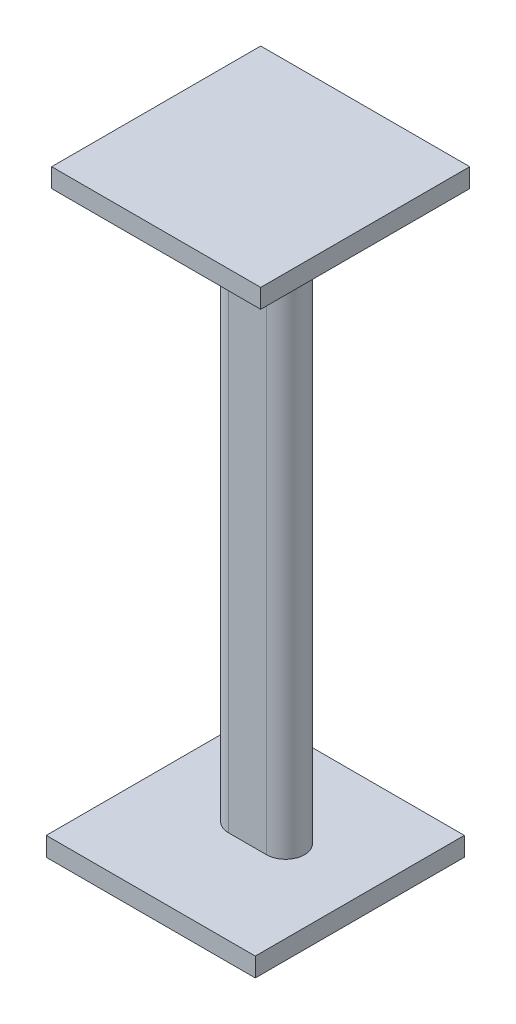
ISO-10303-21;
HEADER;
FILE_DESCRIPTION(('STEP AP214'),'2;1');
FILE_NAME('part.step','',(''),(''),'','','');
FILE_SCHEMA(('AUTOMOTIVE_DESIGN { 1 0 10303 214 1 1 1 1 }'));
ENDSEC;
DATA;
#1=APPLICATION_CONTEXT('core data for automotive mechanical design processes');
#2=APPLICATION_PROTOCOL_DEFINITION('international standard','automotive_design',2000,#1);
#3=PRODUCT_CONTEXT('',#1,'mechanical');
#4=PRODUCT('Part','Part','',(#3));
#5=PRODUCT_RELATED_PRODUCT_CATEGORY('part','',(#4));
#6=PRODUCT_DEFINITION_FORMATION('','',#4);
#7=PRODUCT_DEFINITION_CONTEXT('part definition',#1,'design');
#8=PRODUCT_DEFINITION('design','',#6,#7);
#9=PRODUCT_DEFINITION_SHAPE('','',#8);
#10=(LENGTH_UNIT() NAMED_UNIT(*) SI_UNIT(.MILLI.,.METRE.));
#11=(NAMED_UNIT(*) PLANE_ANGLE_UNIT() SI_UNIT($,.RADIAN.));
#12=(NAMED_UNIT(*) SI_UNIT($,.STERADIAN.) SOLID_ANGLE_UNIT());
#13=UNCERTAINTY_MEASURE_WITH_UNIT(LENGTH_MEASURE(1.E-05),#10,'distance_accuracy_value','');
#14=(GEOMETRIC_REPRESENTATION_CONTEXT(3) GLOBAL_UNCERTAINTY_ASSIGNED_CONTEXT((#13)) GLOBAL_UNIT_ASSIGNED_CONTEXT((#10,
#11,#12)) REPRESENTATION_CONTEXT('',''));
#15=CARTESIAN_POINT('',(0.,0.,0.));
#16=DIRECTION('',(0.,0.,1.));
#17=DIRECTION('',(1.,0.,0.));
#18=AXIS2_PLACEMENT_3D('',#15,#16,#17);
#19=CARTESIAN_POINT('',(0.,38.1,0.));
#20=DIRECTION('',(0.,1.,0.));
#21=DIRECTION('',(0.,0.,1.));
#22=AXIS2_PLACEMENT_3D('',#19,#20,#21);
#23=PLANE('',#22);
#24=DIRECTION('',(0.,0.,1.));
#25=VECTOR('',#24,1.);
#26=CARTESIAN_POINT('',(-391.772860504098,38.1,-296.454880255555));
#27=LINE('',#26,#25);
#28=CARTESIAN_POINT('',(-391.772860504098,38.1,-296.454880255555));
#29=VERTEX_POINT('',#28);
#30=CARTESIAN_POINT('',(-391.772860504098,38.1,122.645119744445));
#31=VERTEX_POINT('',#30);
#32=EDGE_CURVE('E194',#29,#31,#27,.T.);
#33=ORIENTED_EDGE('',*,*,#32,.T.);
#34=DIRECTION('',(1.,0.,0.));
#35=VECTOR('',#34,1.);
#36=CARTESIAN_POINT('',(-391.772860504098,38.1,122.645119744445));
#37=LINE('',#36,#35);
#38=CARTESIAN_POINT('',(27.327139495902,38.1,122.645119744445));
#39=VERTEX_POINT('',#38);
#40=EDGE_CURVE('E87',#31,#39,#37,.T.);
#41=ORIENTED_EDGE('',*,*,#40,.T.);
#42=DIRECTION('',(0.,0.,-1.));
#43=VECTOR('',#42,1.);
#44=CARTESIAN_POINT('',(27.327139495902,38.1,-296.454880255555));
#45=LINE('',#44,#43);
#46=CARTESIAN_POINT('',(27.327139495902,38.1,-296.454880255555));
#47=VERTEX_POINT('',#46);
#48=EDGE_CURVE('E197',#39,#47,#45,.T.);
#49=ORIENTED_EDGE('',*,*,#48,.T.);
#50=DIRECTION('',(-1.,0.,0.));
#51=VECTOR('',#50,1.);
#52=CARTESIAN_POINT('',(-391.772860504098,38.1,-296.454880255555));
#53=LINE('',#52,#51);
#54=EDGE_CURVE('E59',#47,#29,#53,.T.);
#55=ORIENTED_EDGE('',*,*,#54,.T.);
#56=EDGE_LOOP('',(#33,#41,#49,#55));
#57=FACE_BOUND('',#56,.T.);
#58=DIRECTION('',(1.,0.,0.));
#59=VECTOR('',#58,1.);
#60=CARTESIAN_POINT('',(-213.432103513227,38.1,-64.5132983569283));
#61=LINE('',#60,#59);
#62=CARTESIAN_POINT('',(-213.432103513227,38.1,-64.5132983569283));
#63=VERTEX_POINT('',#62);
#64=CARTESIAN_POINT('',(-137.232103513227,38.1,-64.5132983569283));
#65=VERTEX_POINT('',#64);
#66=EDGE_CURVE('E161',#63,#65,#61,.T.);
#67=ORIENTED_EDGE('',*,*,#66,.F.);
#68=CARTESIAN_POINT('',(-213.432103513227,38.1,-102.613298356928));
#69=DIRECTION('',(0.,1.,0.));
#70=DIRECTION('',(0.,0.,1.));
#71=AXIS2_PLACEMENT_3D('',#68,#69,#70);
#72=CIRCLE('',#71,38.1);
#73=CARTESIAN_POINT('',(-213.432103513227,38.1,-140.713298356928));
#74=VERTEX_POINT('',#73);
#75=EDGE_CURVE('E158',#74,#63,#72,.T.);
#76=ORIENTED_EDGE('',*,*,#75,.F.);
#77=DIRECTION('',(-1.,0.,0.));
#78=VECTOR('',#77,1.);
#79=CARTESIAN_POINT('',(-213.432103513227,38.1,-140.713298356928));
#80=LINE('',#79,#78);
#81=CARTESIAN_POINT('',(-137.232103513227,38.1,-140.713298356928));
#82=VERTEX_POINT('',#81);
#83=EDGE_CURVE('E171',#82,#74,#80,.T.);
#84=ORIENTED_EDGE('',*,*,#83,.F.);
#85=CARTESIAN_POINT('',(-137.232103513227,38.1,-102.613298356928));
#86=DIRECTION('',(0.,1.,0.));
#87=DIRECTION('',(0.,0.,1.));
#88=AXIS2_PLACEMENT_3D('',#85,#86,#87);
#89=CIRCLE('',#88,38.1);
#90=EDGE_CURVE('E182',#65,#82,#89,.T.);
#91=ORIENTED_EDGE('',*,*,#90,.F.);
#92=EDGE_LOOP('',(#67,#76,#84,#91));
#93=FACE_BOUND('',#92,.T.);
#94=ADVANCED_FACE('F35',(#57,#93),#23,.T.);
#95=CARTESIAN_POINT('',(-391.772860504098,38.1,-296.454880255555));
#96=DIRECTION('',(1.,0.,0.));
#97=DIRECTION('',(0.,0.,-1.));
#98=AXIS2_PLACEMENT_3D('',#95,#96,#97);
#99=PLANE('',#98);
#100=DIRECTION('',(0.,0.,1.));
#101=VECTOR('',#100,1.);
#102=CARTESIAN_POINT('',(-391.772860504098,0.,-296.454880255555));
#103=LINE('',#102,#101);
#104=CARTESIAN_POINT('',(-391.772860504098,0.,-296.454880255555));
#105=VERTEX_POINT('',#104);
#106=CARTESIAN_POINT('',(-391.772860504098,0.,122.645119744445));
#107=VERTEX_POINT('',#106);
#108=EDGE_CURVE('E193',#105,#107,#103,.T.);
#109=ORIENTED_EDGE('',*,*,#108,.T.);
#110=DIRECTION('',(0.,-1.,0.));
#111=VECTOR('',#110,1.);
#112=CARTESIAN_POINT('',(-391.772860504098,38.1,122.645119744445));
#113=LINE('',#112,#111);
#114=EDGE_CURVE('E11',#31,#107,#113,.T.);
#115=ORIENTED_EDGE('',*,*,#114,.F.);
#116=ORIENTED_EDGE('',*,*,#32,.F.);
#117=DIRECTION('',(0.,-1.,0.));
#118=VECTOR('',#117,1.);
#119=CARTESIAN_POINT('',(-391.772860504098,38.1,-296.454880255555));
#120=LINE('',#119,#118);
#121=EDGE_CURVE('E200',#29,#105,#120,.T.);
#122=ORIENTED_EDGE('',*,*,#121,.T.);
#123=EDGE_LOOP('',(#109,#115,#116,#122));
#124=FACE_BOUND('',#123,.T.);
#125=ADVANCED_FACE('F37',(#124),#99,.F.);
#126=CARTESIAN_POINT('',(-391.772860504098,38.1,122.645119744445));
#127=DIRECTION('',(0.,0.,-1.));
#128=DIRECTION('',(-1.,0.,0.));
#129=AXIS2_PLACEMENT_3D('',#126,#127,#128);
#130=PLANE('',#129);
#131=DIRECTION('',(1.,0.,0.));
#132=VECTOR('',#131,1.);
#133=CARTESIAN_POINT('',(-391.772860504098,0.,122.645119744445));
#134=LINE('',#133,#132);
#135=CARTESIAN_POINT('',(27.327139495902,0.,122.645119744445));
#136=VERTEX_POINT('',#135);
#137=EDGE_CURVE('E203',#107,#136,#134,.T.);
#138=ORIENTED_EDGE('',*,*,#137,.T.);
#139=DIRECTION('',(0.,-1.,0.));
#140=VECTOR('',#139,1.);
#141=CARTESIAN_POINT('',(27.327139495902,38.1,122.645119744445));
#142=LINE('',#141,#140);
#143=EDGE_CURVE('E43',#39,#136,#142,.T.);
#144=ORIENTED_EDGE('',*,*,#143,.F.);
#145=ORIENTED_EDGE('',*,*,#40,.F.);
#146=ORIENTED_EDGE('',*,*,#114,.T.);
#147=EDGE_LOOP('',(#138,#144,#145,#146));
#148=FACE_BOUND('',#147,.T.);
#149=ADVANCED_FACE('F231',(#148),#130,.F.);
#150=CARTESIAN_POINT('',(27.327139495902,38.1,-296.454880255555));
#151=DIRECTION('',(-1.,0.,0.));
#152=DIRECTION('',(0.,0.,1.));
#153=AXIS2_PLACEMENT_3D('',#150,#151,#152);
#154=PLANE('',#153);
#155=DIRECTION('',(0.,0.,-1.));
#156=VECTOR('',#155,1.);
#157=CARTESIAN_POINT('',(27.327139495902,0.,-296.454880255555));
#158=LINE('',#157,#156);
#159=CARTESIAN_POINT('',(27.327139495902,0.,-296.454880255555));
#160=VERTEX_POINT('',#159);
#161=EDGE_CURVE('E205',#136,#160,#158,.T.);
#162=ORIENTED_EDGE('',*,*,#161,.T.);
#163=DIRECTION('',(0.,-1.,0.));
#164=VECTOR('',#163,1.);
#165=CARTESIAN_POINT('',(27.327139495902,38.1,-296.454880255555));
#166=LINE('',#165,#164);
#167=EDGE_CURVE('E209',#47,#160,#166,.T.);
#168=ORIENTED_EDGE('',*,*,#167,.F.);
#169=ORIENTED_EDGE('',*,*,#48,.F.);
#170=ORIENTED_EDGE('',*,*,#143,.T.);
#171=EDGE_LOOP('',(#162,#168,#169,#170));
#172=FACE_BOUND('',#171,.T.);
#173=ADVANCED_FACE('F214',(#172),#154,.F.);
#174=CARTESIAN_POINT('',(-391.772860504098,38.1,-296.454880255555));
#175=DIRECTION('',(0.,0.,1.));
#176=DIRECTION('',(1.,0.,0.));
#177=AXIS2_PLACEMENT_3D('',#174,#175,#176);
#178=PLANE('',#177);
#179=DIRECTION('',(-1.,0.,0.));
#180=VECTOR('',#179,1.);
#181=CARTESIAN_POINT('',(-391.772860504098,0.,-296.454880255555));
#182=LINE('',#181,#180);
#183=EDGE_CURVE('E80',#160,#105,#182,.T.);
#184=ORIENTED_EDGE('',*,*,#183,.T.);
#185=ORIENTED_EDGE('',*,*,#121,.F.);
#186=ORIENTED_EDGE('',*,*,#54,.F.);
#187=ORIENTED_EDGE('',*,*,#167,.T.);
#188=EDGE_LOOP('',(#184,#185,#186,#187));
#189=FACE_BOUND('',#188,.T.);
#190=ADVANCED_FACE('F222',(#189),#178,.F.);
#191=CARTESIAN_POINT('',(0.,0.,0.));
#192=DIRECTION('',(0.,1.,0.));
#193=DIRECTION('',(0.,0.,1.));
#194=AXIS2_PLACEMENT_3D('',#191,#192,#193);
#195=PLANE('',#194);
#196=ORIENTED_EDGE('',*,*,#108,.F.);
#197=ORIENTED_EDGE('',*,*,#183,.F.);
#198=ORIENTED_EDGE('',*,*,#161,.F.);
#199=ORIENTED_EDGE('',*,*,#137,.F.);
#200=EDGE_LOOP('',(#196,#197,#198,#199));
#201=FACE_BOUND('',#200,.T.);
#202=ADVANCED_FACE('F218',(#201),#195,.F.);
#203=CARTESIAN_POINT('',(-213.432103513227,1155.7,-102.613298356928));
#204=DIRECTION('',(0.,-1.,0.));
#205=DIRECTION('',(0.,0.,-1.));
#206=AXIS2_PLACEMENT_3D('',#203,#204,#205);
#207=CYLINDRICAL_SURFACE('',#206,38.1);
#208=ORIENTED_EDGE('',*,*,#75,.T.);
#209=DIRECTION('',(0.,-1.,0.));
#210=VECTOR('',#209,1.);
#211=CARTESIAN_POINT('',(-213.432103513227,1155.7,-64.5132983569283));
#212=LINE('',#211,#210);
#213=CARTESIAN_POINT('',(-213.432103513227,1155.7,-64.5132983569283));
#214=VERTEX_POINT('',#213);
#215=EDGE_CURVE('E191',#214,#63,#212,.T.);
#216=ORIENTED_EDGE('',*,*,#215,.F.);
#217=CARTESIAN_POINT('',(-213.432103513227,1155.7,-102.613298356928));
#218=DIRECTION('',(0.,1.,0.));
#219=DIRECTION('',(0.,0.,1.));
#220=AXIS2_PLACEMENT_3D('',#217,#218,#219);
#221=CIRCLE('',#220,38.1);
#222=CARTESIAN_POINT('',(-213.432103513227,1155.7,-140.713298356928));
#223=VERTEX_POINT('',#222);
#224=EDGE_CURVE('E167',#223,#214,#221,.T.);
#225=ORIENTED_EDGE('',*,*,#224,.F.);
#226=DIRECTION('',(0.,-1.,0.));
#227=VECTOR('',#226,1.);
#228=CARTESIAN_POINT('',(-213.432103513227,1155.7,-140.713298356928));
#229=LINE('',#228,#227);
#230=EDGE_CURVE('E179',#223,#74,#229,.T.);
#231=ORIENTED_EDGE('',*,*,#230,.T.);
#232=EDGE_LOOP('',(#208,#216,#225,#231));
#233=FACE_BOUND('',#232,.T.);
#234=ADVANCED_FACE('F229',(#233),#207,.T.);
#235=CARTESIAN_POINT('',(-213.432103513227,1155.7,-64.5132983569283));
#236=DIRECTION('',(0.,0.,-1.));
#237=DIRECTION('',(-1.,0.,0.));
#238=AXIS2_PLACEMENT_3D('',#235,#236,#237);
#239=PLANE('',#238);
#240=ORIENTED_EDGE('',*,*,#66,.T.);
#241=DIRECTION('',(0.,-1.,0.));
#242=VECTOR('',#241,1.);
#243=CARTESIAN_POINT('',(-137.232103513227,1155.7,-64.5132983569283));
#244=LINE('',#243,#242);
#245=CARTESIAN_POINT('',(-137.232103513227,1155.7,-64.5132983569283));
#246=VERTEX_POINT('',#245);
#247=EDGE_CURVE('E188',#246,#65,#244,.T.);
#248=ORIENTED_EDGE('',*,*,#247,.F.);
#249=DIRECTION('',(1.,0.,0.));
#250=VECTOR('',#249,1.);
#251=CARTESIAN_POINT('',(-213.432103513227,1155.7,-64.5132983569283));
#252=LINE('',#251,#250);
#253=EDGE_CURVE('E170',#214,#246,#252,.T.);
#254=ORIENTED_EDGE('',*,*,#253,.F.);
#255=ORIENTED_EDGE('',*,*,#215,.T.);
#256=EDGE_LOOP('',(#240,#248,#254,#255));
#257=FACE_BOUND('',#256,.T.);
#258=ADVANCED_FACE('F244',(#257),#239,.F.);
#259=CARTESIAN_POINT('',(-137.232103513227,1155.7,-102.613298356928));
#260=DIRECTION('',(0.,-1.,0.));
#261=DIRECTION('',(0.,0.,-1.));
#262=AXIS2_PLACEMENT_3D('',#259,#260,#261);
#263=CYLINDRICAL_SURFACE('',#262,38.1);
#264=ORIENTED_EDGE('',*,*,#90,.T.);
#265=DIRECTION('',(0.,-1.,0.));
#266=VECTOR('',#265,1.);
#267=CARTESIAN_POINT('',(-137.232103513227,1155.7,-140.713298356928));
#268=LINE('',#267,#266);
#269=CARTESIAN_POINT('',(-137.232103513227,1155.7,-140.713298356928));
#270=VERTEX_POINT('',#269);
#271=EDGE_CURVE('E50',#270,#82,#268,.T.);
#272=ORIENTED_EDGE('',*,*,#271,.F.);
#273=CARTESIAN_POINT('',(-137.232103513227,1155.7,-102.613298356928));
#274=DIRECTION('',(0.,1.,0.));
#275=DIRECTION('',(0.,0.,1.));
#276=AXIS2_PLACEMENT_3D('',#273,#274,#275);
#277=CIRCLE('',#276,38.1);
#278=EDGE_CURVE('E174',#246,#270,#277,.T.);
#279=ORIENTED_EDGE('',*,*,#278,.F.);
#280=ORIENTED_EDGE('',*,*,#247,.T.);
#281=EDGE_LOOP('',(#264,#272,#279,#280));
#282=FACE_BOUND('',#281,.T.);
#283=ADVANCED_FACE('F248',(#282),#263,.T.);
#284=CARTESIAN_POINT('',(-213.432103513227,1155.7,-140.713298356928));
#285=DIRECTION('',(0.,0.,1.));
#286=DIRECTION('',(1.,0.,0.));
#287=AXIS2_PLACEMENT_3D('',#284,#285,#286);
#288=PLANE('',#287);
#289=ORIENTED_EDGE('',*,*,#83,.T.);
#290=ORIENTED_EDGE('',*,*,#230,.F.);
#291=DIRECTION('',(-1.,0.,0.));
#292=VECTOR('',#291,1.);
#293=CARTESIAN_POINT('',(-213.432103513227,1155.7,-140.713298356928));
#294=LINE('',#293,#292);
#295=EDGE_CURVE('E177',#270,#223,#294,.T.);
#296=ORIENTED_EDGE('',*,*,#295,.F.);
#297=ORIENTED_EDGE('',*,*,#271,.T.);
#298=EDGE_LOOP('',(#289,#290,#296,#297));
#299=FACE_BOUND('',#298,.T.);
#300=ADVANCED_FACE('F252',(#299),#288,.F.);
#301=CARTESIAN_POINT('',(27.3817389119318,1193.8,-307.251559627694));
#302=DIRECTION('',(-1.,0.,0.));
#303=DIRECTION('',(0.,0.,1.));
#304=AXIS2_PLACEMENT_3D('',#301,#302,#303);
#305=PLANE('',#304);
#306=DIRECTION('',(0.,0.,-1.));
#307=VECTOR('',#306,1.);
#308=CARTESIAN_POINT('',(27.3817389119318,1155.7,-307.251559627694));
#309=LINE('',#308,#307);
#310=CARTESIAN_POINT('',(27.3817389119319,1155.7,111.848440372306));
#311=VERTEX_POINT('',#310);
#312=CARTESIAN_POINT('',(27.3817389119318,1155.7,-307.251559627694));
#313=VERTEX_POINT('',#312);
#314=EDGE_CURVE('E157',#311,#313,#309,.T.);
#315=ORIENTED_EDGE('',*,*,#314,.T.);
#316=DIRECTION('',(0.,-1.,0.));
#317=VECTOR('',#316,1.);
#318=CARTESIAN_POINT('',(27.3817389119318,1193.8,-307.251559627694));
#319=LINE('',#318,#317);
#320=CARTESIAN_POINT('',(27.3817389119318,1193.8,-307.251559627694));
#321=VERTEX_POINT('',#320);
#322=EDGE_CURVE('E137',#321,#313,#319,.T.);
#323=ORIENTED_EDGE('',*,*,#322,.F.);
#324=DIRECTION('',(0.,0.,-1.));
#325=VECTOR('',#324,1.);
#326=CARTESIAN_POINT('',(27.3817389119318,1193.8,-307.251559627694));
#327=LINE('',#326,#325);
#328=CARTESIAN_POINT('',(27.3817389119319,1193.8,111.848440372306));
#329=VERTEX_POINT('',#328);
#330=EDGE_CURVE('E144',#329,#321,#327,.T.);
#331=ORIENTED_EDGE('',*,*,#330,.F.);
#332=DIRECTION('',(0.,-1.,0.));
#333=VECTOR('',#332,1.);
#334=CARTESIAN_POINT('',(27.3817389119319,1193.8,111.848440372306));
#335=LINE('',#334,#333);
#336=EDGE_CURVE('E384',#329,#311,#335,.T.);
#337=ORIENTED_EDGE('',*,*,#336,.T.);
#338=EDGE_LOOP('',(#315,#323,#331,#337));
#339=FACE_BOUND('',#338,.T.);
#340=ADVANCED_FACE('F155',(#339),#305,.F.);
#341=CARTESIAN_POINT('',(27.3817389119318,1193.8,-307.251559627694));
#342=DIRECTION('',(0.,0.,1.));
#343=DIRECTION('',(1.,0.,0.));
#344=AXIS2_PLACEMENT_3D('',#341,#342,#343);
#345=PLANE('',#344);
#346=DIRECTION('',(-1.,0.,0.));
#347=VECTOR('',#346,1.);
#348=CARTESIAN_POINT('',(27.3817389119318,1155.7,-307.251559627694));
#349=LINE('',#348,#347);
#350=CARTESIAN_POINT('',(-391.718261088068,1155.7,-307.251559627694));
#351=VERTEX_POINT('',#350);
#352=EDGE_CURVE('E375',#313,#351,#349,.T.);
#353=ORIENTED_EDGE('',*,*,#352,.T.);
#354=DIRECTION('',(0.,-1.,0.));
#355=VECTOR('',#354,1.);
#356=CARTESIAN_POINT('',(-391.718261088068,1193.8,-307.251559627694));
#357=LINE('',#356,#355);
#358=CARTESIAN_POINT('',(-391.718261088068,1193.8,-307.251559627694));
#359=VERTEX_POINT('',#358);
#360=EDGE_CURVE('E140',#359,#351,#357,.T.);
#361=ORIENTED_EDGE('',*,*,#360,.F.);
#362=DIRECTION('',(-1.,0.,0.));
#363=VECTOR('',#362,1.);
#364=CARTESIAN_POINT('',(27.3817389119318,1193.8,-307.251559627694));
#365=LINE('',#364,#363);
#366=EDGE_CURVE('E133',#321,#359,#365,.T.);
#367=ORIENTED_EDGE('',*,*,#366,.F.);
#368=ORIENTED_EDGE('',*,*,#322,.T.);
#369=EDGE_LOOP('',(#353,#361,#367,#368));
#370=FACE_BOUND('',#369,.T.);
#371=ADVANCED_FACE('F135',(#370),#345,.F.);
#372=CARTESIAN_POINT('',(-391.718261088068,1193.8,-307.251559627694));
#373=DIRECTION('',(1.,0.,0.));
#374=DIRECTION('',(0.,0.,-1.));
#375=AXIS2_PLACEMENT_3D('',#372,#373,#374);
#376=PLANE('',#375);
#377=DIRECTION('',(0.,0.,1.));
#378=VECTOR('',#377,1.);
#379=CARTESIAN_POINT('',(-391.718261088068,1155.7,-307.251559627694));
#380=LINE('',#379,#378);
#381=CARTESIAN_POINT('',(-391.718261088068,1155.7,111.848440372306));
#382=VERTEX_POINT('',#381);
#383=EDGE_CURVE('E377',#351,#382,#380,.T.);
#384=ORIENTED_EDGE('',*,*,#383,.T.);
#385=DIRECTION('',(0.,-1.,0.));
#386=VECTOR('',#385,1.);
#387=CARTESIAN_POINT('',(-391.718261088068,1193.8,111.848440372306));
#388=LINE('',#387,#386);
#389=CARTESIAN_POINT('',(-391.718261088068,1193.8,111.848440372306));
#390=VERTEX_POINT('',#389);
#391=EDGE_CURVE('E163',#390,#382,#388,.T.);
#392=ORIENTED_EDGE('',*,*,#391,.F.);
#393=DIRECTION('',(0.,0.,1.));
#394=VECTOR('',#393,1.);
#395=CARTESIAN_POINT('',(-391.718261088068,1193.8,-307.251559627694));
#396=LINE('',#395,#394);
#397=EDGE_CURVE('E143',#359,#390,#396,.T.);
#398=ORIENTED_EDGE('',*,*,#397,.F.);
#399=ORIENTED_EDGE('',*,*,#360,.T.);
#400=EDGE_LOOP('',(#384,#392,#398,#399));
#401=FACE_BOUND('',#400,.T.);
#402=ADVANCED_FACE('F260',(#401),#376,.F.);
#403=CARTESIAN_POINT('',(27.3817389119319,1193.8,111.848440372306));
#404=DIRECTION('',(0.,0.,-1.));
#405=DIRECTION('',(-1.,0.,0.));
#406=AXIS2_PLACEMENT_3D('',#403,#404,#405);
#407=PLANE('',#406);
#408=DIRECTION('',(1.,0.,0.));
#409=VECTOR('',#408,1.);
#410=CARTESIAN_POINT('',(27.3817389119319,1155.7,111.848440372306));
#411=LINE('',#410,#409);
#412=EDGE_CURVE('E153',#382,#311,#411,.T.);
#413=ORIENTED_EDGE('',*,*,#412,.T.);
#414=ORIENTED_EDGE('',*,*,#336,.F.);
#415=DIRECTION('',(1.,0.,0.));
#416=VECTOR('',#415,1.);
#417=CARTESIAN_POINT('',(27.3817389119319,1193.8,111.848440372306));
#418=LINE('',#417,#416);
#419=EDGE_CURVE('E149',#390,#329,#418,.T.);
#420=ORIENTED_EDGE('',*,*,#419,.F.);
#421=ORIENTED_EDGE('',*,*,#391,.T.);
#422=EDGE_LOOP('',(#413,#414,#420,#421));
#423=FACE_BOUND('',#422,.T.);
#424=ADVANCED_FACE('F263',(#423),#407,.F.);
#425=CARTESIAN_POINT('',(0.,1193.8,0.));
#426=DIRECTION('',(0.,-1.,0.));
#427=DIRECTION('',(0.,0.,-1.));
#428=AXIS2_PLACEMENT_3D('',#425,#426,#427);
#429=PLANE('',#428);
#430=ORIENTED_EDGE('',*,*,#330,.T.);
#431=ORIENTED_EDGE('',*,*,#366,.T.);
#432=ORIENTED_EDGE('',*,*,#397,.T.);
#433=ORIENTED_EDGE('',*,*,#419,.T.);
#434=EDGE_LOOP('',(#430,#431,#432,#433));
#435=FACE_BOUND('',#434,.T.);
#436=ADVANCED_FACE('F147',(#435),#429,.F.);
#437=CARTESIAN_POINT('',(0.,1155.7,0.));
#438=DIRECTION('',(0.,-1.,0.));
#439=DIRECTION('',(0.,0.,-1.));
#440=AXIS2_PLACEMENT_3D('',#437,#438,#439);
#441=PLANE('',#440);
#442=ORIENTED_EDGE('',*,*,#295,.T.);
#443=ORIENTED_EDGE('',*,*,#224,.T.);
#444=ORIENTED_EDGE('',*,*,#253,.T.);
#445=ORIENTED_EDGE('',*,*,#278,.T.);
#446=EDGE_LOOP('',(#442,#443,#444,#445));
#447=FACE_BOUND('',#446,.T.);
#448=ORIENTED_EDGE('',*,*,#314,.F.);
#449=ORIENTED_EDGE('',*,*,#412,.F.);
#450=ORIENTED_EDGE('',*,*,#383,.F.);
#451=ORIENTED_EDGE('',*,*,#352,.F.);
#452=EDGE_LOOP('',(#448,#449,#450,#451));
#453=FACE_BOUND('',#452,.T.);
#454=ADVANCED_FACE('F268',(#447,#453),#441,.T.);
#455=CLOSED_SHELL('',(#94,#125,#149,#173,#190,#202,#234,#258,#283,#300,#340,#371,#402,#424,#436,#454));
#456=MANIFOLD_SOLID_BREP('B2',#455);
#457=ADVANCED_BREP_SHAPE_REPRESENTATION('',(#18,#456),#14);
#458=SHAPE_DEFINITION_REPRESENTATION(#9,#457);
ENDSEC;
END-ISO-10303-21;
